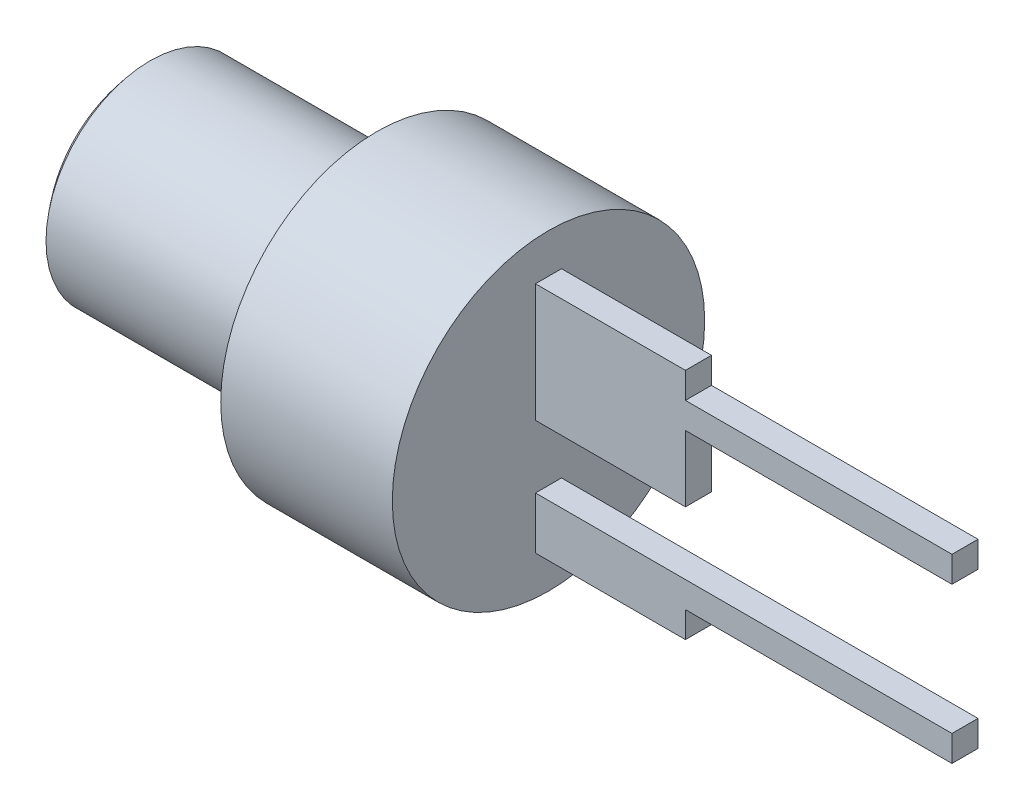
ISO-10303-21;
HEADER;
FILE_DESCRIPTION(('STEP AP214'),'2;1');
FILE_NAME('part.step','',(''),(''),'','','');
FILE_SCHEMA(('AUTOMOTIVE_DESIGN { 1 0 10303 214 1 1 1 1 }'));
ENDSEC;
DATA;
#1=APPLICATION_CONTEXT('core data for automotive mechanical design processes');
#2=APPLICATION_PROTOCOL_DEFINITION('international standard','automotive_design',2000,#1);
#3=PRODUCT_CONTEXT('',#1,'mechanical');
#4=PRODUCT('Part','Part','',(#3));
#5=PRODUCT_RELATED_PRODUCT_CATEGORY('part','',(#4));
#6=PRODUCT_DEFINITION_FORMATION('','',#4);
#7=PRODUCT_DEFINITION_CONTEXT('part definition',#1,'design');
#8=PRODUCT_DEFINITION('design','',#6,#7);
#9=PRODUCT_DEFINITION_SHAPE('','',#8);
#10=(LENGTH_UNIT() NAMED_UNIT(*) SI_UNIT(.MILLI.,.METRE.));
#11=(NAMED_UNIT(*) PLANE_ANGLE_UNIT() SI_UNIT($,.RADIAN.));
#12=(NAMED_UNIT(*) SI_UNIT($,.STERADIAN.) SOLID_ANGLE_UNIT());
#13=UNCERTAINTY_MEASURE_WITH_UNIT(LENGTH_MEASURE(1.E-05),#10,'distance_accuracy_value','');
#14=(GEOMETRIC_REPRESENTATION_CONTEXT(3) GLOBAL_UNCERTAINTY_ASSIGNED_CONTEXT((#13)) GLOBAL_UNIT_ASSIGNED_CONTEXT((#10,
#11,#12)) REPRESENTATION_CONTEXT('',''));
#15=CARTESIAN_POINT('',(0.,0.,0.));
#16=DIRECTION('',(0.,0.,1.));
#17=DIRECTION('',(1.,0.,0.));
#18=AXIS2_PLACEMENT_3D('',#15,#16,#17);
#19=CARTESIAN_POINT('',(0.,0.,0.));
#20=DIRECTION('',(1.,0.,0.));
#21=DIRECTION('',(0.,1.,0.));
#22=AXIS2_PLACEMENT_3D('',#19,#20,#21);
#23=PLANE('',#22);
#24=DIRECTION('',(0.,0.,-1.));
#25=VECTOR('',#24,1.);
#26=CARTESIAN_POINT('',(0.,-0.0508000000000003,0.396875));
#27=LINE('',#26,#25);
#28=CARTESIAN_POINT('',(0.,-0.0508000000000003,0.396875));
#29=VERTEX_POINT('',#28);
#30=CARTESIAN_POINT('',(0.,-0.0508000000000003,-0.396875));
#31=VERTEX_POINT('',#30);
#32=EDGE_CURVE('E563',#29,#31,#27,.T.);
#33=ORIENTED_EDGE('',*,*,#32,.F.);
#34=DIRECTION('',(0.,-1.,0.));
#35=VECTOR('',#34,1.);
#36=CARTESIAN_POINT('',(0.,3.556,0.396875));
#37=LINE('',#36,#35);
#38=CARTESIAN_POINT('',(0.,3.556,0.396875));
#39=VERTEX_POINT('',#38);
#40=EDGE_CURVE('E536',#39,#29,#37,.T.);
#41=ORIENTED_EDGE('',*,*,#40,.F.);
#42=DIRECTION('',(0.,0.,-1.));
#43=VECTOR('',#42,1.);
#44=CARTESIAN_POINT('',(0.,3.556,0.396875));
#45=LINE('',#44,#43);
#46=CARTESIAN_POINT('',(0.,3.556,-0.396875));
#47=VERTEX_POINT('',#46);
#48=EDGE_CURVE('E566',#39,#47,#45,.T.);
#49=ORIENTED_EDGE('',*,*,#48,.T.);
#50=DIRECTION('',(0.,-1.,0.));
#51=VECTOR('',#50,1.);
#52=CARTESIAN_POINT('',(0.,3.556,-0.396875));
#53=LINE('',#52,#51);
#54=EDGE_CURVE('E513',#47,#31,#53,.T.);
#55=ORIENTED_EDGE('',*,*,#54,.T.);
#56=EDGE_LOOP('',(#33,#41,#49,#55));
#57=FACE_BOUND('',#56,.T.);
#58=CARTESIAN_POINT('',(0.,0.,0.));
#59=DIRECTION('',(1.,0.,0.));
#60=DIRECTION('',(0.,1.,0.));
#61=AXIS2_PLACEMENT_3D('',#58,#59,#60);
#62=CIRCLE('',#61,4.7625);
#63=CARTESIAN_POINT('',(0.,4.7625,0.));
#64=VERTEX_POINT('',#63);
#65=EDGE_CURVE('E11',#64,#64,#62,.T.);
#66=ORIENTED_EDGE('',*,*,#65,.T.);
#67=EDGE_LOOP('',(#66));
#68=FACE_BOUND('',#67,.T.);
#69=DIRECTION('',(0.,0.,-1.));
#70=VECTOR('',#69,1.);
#71=CARTESIAN_POINT('',(0.,-3.556,0.396875));
#72=LINE('',#71,#70);
#73=CARTESIAN_POINT('',(0.,-3.556,0.396875));
#74=VERTEX_POINT('',#73);
#75=CARTESIAN_POINT('',(0.,-3.556,-0.396875));
#76=VERTEX_POINT('',#75);
#77=EDGE_CURVE('E374',#74,#76,#72,.T.);
#78=ORIENTED_EDGE('',*,*,#77,.F.);
#79=DIRECTION('',(0.,-1.,0.));
#80=VECTOR('',#79,1.);
#81=CARTESIAN_POINT('',(0.,-1.9685,0.396875));
#82=LINE('',#81,#80);
#83=CARTESIAN_POINT('',(0.,-1.9685,0.396875));
#84=VERTEX_POINT('',#83);
#85=EDGE_CURVE('E379',#84,#74,#82,.T.);
#86=ORIENTED_EDGE('',*,*,#85,.F.);
#87=DIRECTION('',(0.,0.,-1.));
#88=VECTOR('',#87,1.);
#89=CARTESIAN_POINT('',(0.,-1.9685,0.396875));
#90=LINE('',#89,#88);
#91=CARTESIAN_POINT('',(0.,-1.9685,-0.396875));
#92=VERTEX_POINT('',#91);
#93=EDGE_CURVE('E502',#84,#92,#90,.T.);
#94=ORIENTED_EDGE('',*,*,#93,.T.);
#95=DIRECTION('',(0.,-1.,0.));
#96=VECTOR('',#95,1.);
#97=CARTESIAN_POINT('',(0.,-1.9685,-0.396875));
#98=LINE('',#97,#96);
#99=EDGE_CURVE('E481',#92,#76,#98,.T.);
#100=ORIENTED_EDGE('',*,*,#99,.T.);
#101=EDGE_LOOP('',(#78,#86,#94,#100));
#102=FACE_BOUND('',#101,.T.);
#103=ADVANCED_FACE('F360',(#57,#68,#102),#23,.T.);
#104=CARTESIAN_POINT('',(0.,0.,0.));
#105=DIRECTION('',(1.,0.,0.));
#106=DIRECTION('',(0.,1.,0.));
#107=AXIS2_PLACEMENT_3D('',#104,#105,#106);
#108=CYLINDRICAL_SURFACE('',#107,4.7625);
#109=CARTESIAN_POINT('',(-5.2324,0.,0.));
#110=DIRECTION('',(1.,0.,0.));
#111=DIRECTION('',(0.,1.,0.));
#112=AXIS2_PLACEMENT_3D('',#109,#110,#111);
#113=CIRCLE('',#112,4.7625);
#114=CARTESIAN_POINT('',(-5.2324,4.7625,0.));
#115=VERTEX_POINT('',#114);
#116=EDGE_CURVE('E367',#115,#115,#113,.T.);
#117=ORIENTED_EDGE('',*,*,#116,.T.);
#118=EDGE_LOOP('',(#117));
#119=FACE_BOUND('',#118,.T.);
#120=ORIENTED_EDGE('',*,*,#65,.F.);
#121=EDGE_LOOP('',(#120));
#122=FACE_BOUND('',#121,.T.);
#123=ADVANCED_FACE('F576',(#119,#122),#108,.T.);
#124=CARTESIAN_POINT('',(-5.2324,3.175,0.));
#125=DIRECTION('',(-1.,0.,0.));
#126=DIRECTION('',(0.,-1.,0.));
#127=AXIS2_PLACEMENT_3D('',#124,#125,#126);
#128=PLANE('',#127);
#129=CARTESIAN_POINT('',(-5.2324,0.,0.));
#130=DIRECTION('',(1.,0.,0.));
#131=DIRECTION('',(0.,1.,0.));
#132=AXIS2_PLACEMENT_3D('',#129,#130,#131);
#133=CIRCLE('',#132,3.175);
#134=CARTESIAN_POINT('',(-5.2324,3.175,0.));
#135=VERTEX_POINT('',#134);
#136=EDGE_CURVE('E571',#135,#135,#133,.T.);
#137=ORIENTED_EDGE('',*,*,#136,.T.);
#138=EDGE_LOOP('',(#137));
#139=FACE_BOUND('',#138,.T.);
#140=ORIENTED_EDGE('',*,*,#116,.F.);
#141=EDGE_LOOP('',(#140));
#142=FACE_BOUND('',#141,.T.);
#143=ADVANCED_FACE('F579',(#139,#142),#128,.T.);
#144=CARTESIAN_POINT('',(0.,0.,0.));
#145=DIRECTION('',(1.,0.,0.));
#146=DIRECTION('',(0.,1.,0.));
#147=AXIS2_PLACEMENT_3D('',#144,#145,#146);
#148=CYLINDRICAL_SURFACE('',#147,3.175);
#149=CARTESIAN_POINT('',(-12.1476579142809,0.,0.));
#150=DIRECTION('',(1.,0.,0.));
#151=DIRECTION('',(0.,1.,0.));
#152=AXIS2_PLACEMENT_3D('',#149,#150,#151);
#153=CIRCLE('',#152,3.175);
#154=CARTESIAN_POINT('',(-12.1476579142809,3.175,0.));
#155=VERTEX_POINT('',#154);
#156=EDGE_CURVE('E568',#155,#155,#153,.T.);
#157=ORIENTED_EDGE('',*,*,#156,.T.);
#158=EDGE_LOOP('',(#157));
#159=FACE_BOUND('',#158,.T.);
#160=ORIENTED_EDGE('',*,*,#136,.F.);
#161=EDGE_LOOP('',(#160));
#162=FACE_BOUND('',#161,.T.);
#163=ADVANCED_FACE('F581',(#159,#162),#148,.T.);
#164=CARTESIAN_POINT('',(-8.5979,0.,0.));
#165=DIRECTION('',(1.,0.,0.));
#166=DIRECTION('',(0.,1.,0.));
#167=AXIS2_PLACEMENT_3D('',#164,#165,#166);
#168=SPHERICAL_SURFACE('',#167,4.7625);
#169=ORIENTED_EDGE('',*,*,#156,.F.);
#170=EDGE_LOOP('',(#169));
#171=FACE_BOUND('',#170,.T.);
#172=ADVANCED_FACE('F588',(#171),#168,.T.);
#173=CARTESIAN_POINT('',(0.,3.556,0.396875));
#174=DIRECTION('',(0.,-1.,0.));
#175=DIRECTION('',(0.,0.,-1.));
#176=AXIS2_PLACEMENT_3D('',#173,#174,#175);
#177=PLANE('',#176);
#178=DIRECTION('',(0.,0.,-1.));
#179=VECTOR('',#178,1.);
#180=CARTESIAN_POINT('',(4.572,3.556,0.396875));
#181=LINE('',#180,#179);
#182=CARTESIAN_POINT('',(4.572,3.556,0.396875));
#183=VERTEX_POINT('',#182);
#184=CARTESIAN_POINT('',(4.572,3.556,-0.396875));
#185=VERTEX_POINT('',#184);
#186=EDGE_CURVE('E551',#183,#185,#181,.T.);
#187=ORIENTED_EDGE('',*,*,#186,.T.);
#188=DIRECTION('',(-1.,0.,0.));
#189=VECTOR('',#188,1.);
#190=CARTESIAN_POINT('',(0.,3.556,-0.396875));
#191=LINE('',#190,#189);
#192=EDGE_CURVE('E510',#185,#47,#191,.T.);
#193=ORIENTED_EDGE('',*,*,#192,.T.);
#194=ORIENTED_EDGE('',*,*,#48,.F.);
#195=DIRECTION('',(-1.,0.,0.));
#196=VECTOR('',#195,1.);
#197=CARTESIAN_POINT('',(0.,3.556,0.396875));
#198=LINE('',#197,#196);
#199=EDGE_CURVE('E533',#183,#39,#198,.T.);
#200=ORIENTED_EDGE('',*,*,#199,.F.);
#201=EDGE_LOOP('',(#187,#193,#194,#200));
#202=FACE_BOUND('',#201,.T.);
#203=ADVANCED_FACE('F636',(#202),#177,.F.);
#204=CARTESIAN_POINT('',(4.572,-0.0507999999999997,0.396875));
#205=DIRECTION('',(0.,1.,0.));
#206=DIRECTION('',(-1.,0.,0.));
#207=AXIS2_PLACEMENT_3D('',#204,#205,#206);
#208=PLANE('',#207);
#209=ORIENTED_EDGE('',*,*,#32,.T.);
#210=DIRECTION('',(1.,0.,0.));
#211=VECTOR('',#210,1.);
#212=CARTESIAN_POINT('',(4.572,-0.0507999999999997,-0.396875));
#213=LINE('',#212,#211);
#214=CARTESIAN_POINT('',(4.572,-0.0507999999999997,-0.396875));
#215=VERTEX_POINT('',#214);
#216=EDGE_CURVE('E515',#31,#215,#213,.T.);
#217=ORIENTED_EDGE('',*,*,#216,.T.);
#218=DIRECTION('',(0.,0.,-1.));
#219=VECTOR('',#218,1.);
#220=CARTESIAN_POINT('',(4.572,-0.0507999999999997,0.396875));
#221=LINE('',#220,#219);
#222=CARTESIAN_POINT('',(4.572,-0.0507999999999997,0.396875));
#223=VERTEX_POINT('',#222);
#224=EDGE_CURVE('E561',#223,#215,#221,.T.);
#225=ORIENTED_EDGE('',*,*,#224,.F.);
#226=DIRECTION('',(1.,0.,0.));
#227=VECTOR('',#226,1.);
#228=CARTESIAN_POINT('',(4.572,-0.0507999999999997,0.396875));
#229=LINE('',#228,#227);
#230=EDGE_CURVE('E539',#29,#223,#229,.T.);
#231=ORIENTED_EDGE('',*,*,#230,.F.);
#232=EDGE_LOOP('',(#209,#217,#225,#231));
#233=FACE_BOUND('',#232,.T.);
#234=ADVANCED_FACE('F608',(#233),#208,.F.);
#235=CARTESIAN_POINT('',(4.572,1.9685,0.396875));
#236=DIRECTION('',(-1.,0.,0.));
#237=DIRECTION('',(0.,0.,1.));
#238=AXIS2_PLACEMENT_3D('',#235,#236,#237);
#239=PLANE('',#238);
#240=ORIENTED_EDGE('',*,*,#224,.T.);
#241=DIRECTION('',(0.,1.,0.));
#242=VECTOR('',#241,1.);
#243=CARTESIAN_POINT('',(4.572,1.9685,-0.396875));
#244=LINE('',#243,#242);
#245=CARTESIAN_POINT('',(4.572,1.9685,-0.396875));
#246=VERTEX_POINT('',#245);
#247=EDGE_CURVE('E518',#215,#246,#244,.T.);
#248=ORIENTED_EDGE('',*,*,#247,.T.);
#249=DIRECTION('',(0.,0.,-1.));
#250=VECTOR('',#249,1.);
#251=CARTESIAN_POINT('',(4.572,1.9685,0.396875));
#252=LINE('',#251,#250);
#253=CARTESIAN_POINT('',(4.572,1.9685,0.396875));
#254=VERTEX_POINT('',#253);
#255=EDGE_CURVE('E559',#254,#246,#252,.T.);
#256=ORIENTED_EDGE('',*,*,#255,.F.);
#257=DIRECTION('',(0.,1.,0.));
#258=VECTOR('',#257,1.);
#259=CARTESIAN_POINT('',(4.572,1.9685,0.396875));
#260=LINE('',#259,#258);
#261=EDGE_CURVE('E541',#223,#254,#260,.T.);
#262=ORIENTED_EDGE('',*,*,#261,.F.);
#263=EDGE_LOOP('',(#240,#248,#256,#262));
#264=FACE_BOUND('',#263,.T.);
#265=ADVANCED_FACE('F613',(#264),#239,.F.);
#266=CARTESIAN_POINT('',(12.7,1.9685,0.396875));
#267=DIRECTION('',(0.,1.,0.));
#268=DIRECTION('',(-1.,0.,0.));
#269=AXIS2_PLACEMENT_3D('',#266,#267,#268);
#270=PLANE('',#269);
#271=ORIENTED_EDGE('',*,*,#255,.T.);
#272=DIRECTION('',(1.,0.,0.));
#273=VECTOR('',#272,1.);
#274=CARTESIAN_POINT('',(12.7,1.9685,-0.396875));
#275=LINE('',#274,#273);
#276=CARTESIAN_POINT('',(12.7,1.9685,-0.396875));
#277=VERTEX_POINT('',#276);
#278=EDGE_CURVE('E521',#246,#277,#275,.T.);
#279=ORIENTED_EDGE('',*,*,#278,.T.);
#280=DIRECTION('',(0.,0.,-1.));
#281=VECTOR('',#280,1.);
#282=CARTESIAN_POINT('',(12.7,1.9685,0.396875));
#283=LINE('',#282,#281);
#284=CARTESIAN_POINT('',(12.7,1.9685,0.396875));
#285=VERTEX_POINT('',#284);
#286=EDGE_CURVE('E557',#285,#277,#283,.T.);
#287=ORIENTED_EDGE('',*,*,#286,.F.);
#288=DIRECTION('',(1.,0.,0.));
#289=VECTOR('',#288,1.);
#290=CARTESIAN_POINT('',(12.7,1.9685,0.396875));
#291=LINE('',#290,#289);
#292=EDGE_CURVE('E543',#254,#285,#291,.T.);
#293=ORIENTED_EDGE('',*,*,#292,.F.);
#294=EDGE_LOOP('',(#271,#279,#287,#293));
#295=FACE_BOUND('',#294,.T.);
#296=ADVANCED_FACE('F619',(#295),#270,.F.);
#297=CARTESIAN_POINT('',(12.7,2.76225,0.396875));
#298=DIRECTION('',(-1.,0.,0.));
#299=DIRECTION('',(0.,0.,1.));
#300=AXIS2_PLACEMENT_3D('',#297,#298,#299);
#301=PLANE('',#300);
#302=ORIENTED_EDGE('',*,*,#286,.T.);
#303=DIRECTION('',(0.,1.,0.));
#304=VECTOR('',#303,1.);
#305=CARTESIAN_POINT('',(12.7,2.76225,-0.396875));
#306=LINE('',#305,#304);
#307=CARTESIAN_POINT('',(12.7,2.76225,-0.396875));
#308=VERTEX_POINT('',#307);
#309=EDGE_CURVE('E524',#277,#308,#306,.T.);
#310=ORIENTED_EDGE('',*,*,#309,.T.);
#311=DIRECTION('',(0.,0.,-1.));
#312=VECTOR('',#311,1.);
#313=CARTESIAN_POINT('',(12.7,2.76225,0.396875));
#314=LINE('',#313,#312);
#315=CARTESIAN_POINT('',(12.7,2.76225,0.396875));
#316=VERTEX_POINT('',#315);
#317=EDGE_CURVE('E555',#316,#308,#314,.T.);
#318=ORIENTED_EDGE('',*,*,#317,.F.);
#319=DIRECTION('',(0.,1.,0.));
#320=VECTOR('',#319,1.);
#321=CARTESIAN_POINT('',(12.7,2.76225,0.396875));
#322=LINE('',#321,#320);
#323=EDGE_CURVE('E545',#285,#316,#322,.T.);
#324=ORIENTED_EDGE('',*,*,#323,.F.);
#325=EDGE_LOOP('',(#302,#310,#318,#324));
#326=FACE_BOUND('',#325,.T.);
#327=ADVANCED_FACE('F623',(#326),#301,.F.);
#328=CARTESIAN_POINT('',(4.572,2.76225,0.396875));
#329=DIRECTION('',(0.,-1.,0.));
#330=DIRECTION('',(0.,0.,-1.));
#331=AXIS2_PLACEMENT_3D('',#328,#329,#330);
#332=PLANE('',#331);
#333=ORIENTED_EDGE('',*,*,#317,.T.);
#334=DIRECTION('',(-1.,0.,0.));
#335=VECTOR('',#334,1.);
#336=CARTESIAN_POINT('',(4.572,2.76225,-0.396875));
#337=LINE('',#336,#335);
#338=CARTESIAN_POINT('',(4.572,2.76225,-0.396875));
#339=VERTEX_POINT('',#338);
#340=EDGE_CURVE('E527',#308,#339,#337,.T.);
#341=ORIENTED_EDGE('',*,*,#340,.T.);
#342=DIRECTION('',(0.,0.,-1.));
#343=VECTOR('',#342,1.);
#344=CARTESIAN_POINT('',(4.572,2.76225,0.396875));
#345=LINE('',#344,#343);
#346=CARTESIAN_POINT('',(4.572,2.76225,0.396875));
#347=VERTEX_POINT('',#346);
#348=EDGE_CURVE('E553',#347,#339,#345,.T.);
#349=ORIENTED_EDGE('',*,*,#348,.F.);
#350=DIRECTION('',(-1.,0.,0.));
#351=VECTOR('',#350,1.);
#352=CARTESIAN_POINT('',(4.572,2.76225,0.396875));
#353=LINE('',#352,#351);
#354=EDGE_CURVE('E547',#316,#347,#353,.T.);
#355=ORIENTED_EDGE('',*,*,#354,.F.);
#356=EDGE_LOOP('',(#333,#341,#349,#355));
#357=FACE_BOUND('',#356,.T.);
#358=ADVANCED_FACE('F628',(#357),#332,.F.);
#359=CARTESIAN_POINT('',(4.572,3.556,0.396875));
#360=DIRECTION('',(-1.,0.,0.));
#361=DIRECTION('',(0.,0.,1.));
#362=AXIS2_PLACEMENT_3D('',#359,#360,#361);
#363=PLANE('',#362);
#364=ORIENTED_EDGE('',*,*,#348,.T.);
#365=DIRECTION('',(0.,1.,0.));
#366=VECTOR('',#365,1.);
#367=CARTESIAN_POINT('',(4.572,3.556,-0.396875));
#368=LINE('',#367,#366);
#369=EDGE_CURVE('E530',#339,#185,#368,.T.);
#370=ORIENTED_EDGE('',*,*,#369,.T.);
#371=ORIENTED_EDGE('',*,*,#186,.F.);
#372=DIRECTION('',(0.,1.,0.));
#373=VECTOR('',#372,1.);
#374=CARTESIAN_POINT('',(4.572,3.556,0.396875));
#375=LINE('',#374,#373);
#376=EDGE_CURVE('E549',#347,#183,#375,.T.);
#377=ORIENTED_EDGE('',*,*,#376,.F.);
#378=EDGE_LOOP('',(#364,#370,#371,#377));
#379=FACE_BOUND('',#378,.T.);
#380=ADVANCED_FACE('F632',(#379),#363,.F.);
#381=CARTESIAN_POINT('',(4.572,3.556,0.396875));
#382=DIRECTION('',(0.,0.,-1.));
#383=DIRECTION('',(-1.,0.,0.));
#384=AXIS2_PLACEMENT_3D('',#381,#382,#383);
#385=PLANE('',#384);
#386=ORIENTED_EDGE('',*,*,#199,.T.);
#387=ORIENTED_EDGE('',*,*,#40,.T.);
#388=ORIENTED_EDGE('',*,*,#230,.T.);
#389=ORIENTED_EDGE('',*,*,#261,.T.);
#390=ORIENTED_EDGE('',*,*,#292,.T.);
#391=ORIENTED_EDGE('',*,*,#323,.T.);
#392=ORIENTED_EDGE('',*,*,#354,.T.);
#393=ORIENTED_EDGE('',*,*,#376,.T.);
#394=EDGE_LOOP('',(#386,#387,#388,#389,#390,#391,#392,#393));
#395=FACE_BOUND('',#394,.T.);
#396=ADVANCED_FACE('F604',(#395),#385,.F.);
#397=CARTESIAN_POINT('',(4.572,3.556,-0.396875));
#398=DIRECTION('',(0.,0.,-1.));
#399=DIRECTION('',(-1.,0.,0.));
#400=AXIS2_PLACEMENT_3D('',#397,#398,#399);
#401=PLANE('',#400);
#402=ORIENTED_EDGE('',*,*,#192,.F.);
#403=ORIENTED_EDGE('',*,*,#369,.F.);
#404=ORIENTED_EDGE('',*,*,#340,.F.);
#405=ORIENTED_EDGE('',*,*,#309,.F.);
#406=ORIENTED_EDGE('',*,*,#278,.F.);
#407=ORIENTED_EDGE('',*,*,#247,.F.);
#408=ORIENTED_EDGE('',*,*,#216,.F.);
#409=ORIENTED_EDGE('',*,*,#54,.F.);
#410=EDGE_LOOP('',(#402,#403,#404,#405,#406,#407,#408,#409));
#411=FACE_BOUND('',#410,.T.);
#412=ADVANCED_FACE('F638',(#411),#401,.T.);
#413=CARTESIAN_POINT('',(4.572,-3.556,0.396875));
#414=DIRECTION('',(0.,1.,0.));
#415=DIRECTION('',(-1.,0.,0.));
#416=AXIS2_PLACEMENT_3D('',#413,#414,#415);
#417=PLANE('',#416);
#418=ORIENTED_EDGE('',*,*,#77,.T.);
#419=DIRECTION('',(1.,0.,0.));
#420=VECTOR('',#419,1.);
#421=CARTESIAN_POINT('',(4.572,-3.556,-0.396875));
#422=LINE('',#421,#420);
#423=CARTESIAN_POINT('',(4.572,-3.556,-0.396875));
#424=VERTEX_POINT('',#423);
#425=EDGE_CURVE('E475',#76,#424,#422,.T.);
#426=ORIENTED_EDGE('',*,*,#425,.T.);
#427=DIRECTION('',(0.,0.,-1.));
#428=VECTOR('',#427,1.);
#429=CARTESIAN_POINT('',(4.572,-3.556,0.396875));
#430=LINE('',#429,#428);
#431=CARTESIAN_POINT('',(4.572,-3.556,0.396875));
#432=VERTEX_POINT('',#431);
#433=EDGE_CURVE('E460',#432,#424,#430,.T.);
#434=ORIENTED_EDGE('',*,*,#433,.F.);
#435=DIRECTION('',(1.,0.,0.));
#436=VECTOR('',#435,1.);
#437=CARTESIAN_POINT('',(4.572,-3.556,0.396875));
#438=LINE('',#437,#436);
#439=EDGE_CURVE('E493',#74,#432,#438,.T.);
#440=ORIENTED_EDGE('',*,*,#439,.F.);
#441=EDGE_LOOP('',(#418,#426,#434,#440));
#442=FACE_BOUND('',#441,.T.);
#443=ADVANCED_FACE('F480',(#442),#417,.F.);
#444=CARTESIAN_POINT('',(4.572,-2.76225,0.396875));
#445=DIRECTION('',(-1.,0.,0.));
#446=DIRECTION('',(0.,-1.,0.));
#447=AXIS2_PLACEMENT_3D('',#444,#445,#446);
#448=PLANE('',#447);
#449=ORIENTED_EDGE('',*,*,#433,.T.);
#450=DIRECTION('',(0.,1.,0.));
#451=VECTOR('',#450,1.);
#452=CARTESIAN_POINT('',(4.572,-2.76225,-0.396875));
#453=LINE('',#452,#451);
#454=CARTESIAN_POINT('',(4.572,-2.76225,-0.396875));
#455=VERTEX_POINT('',#454);
#456=EDGE_CURVE('E464',#424,#455,#453,.T.);
#457=ORIENTED_EDGE('',*,*,#456,.T.);
#458=DIRECTION('',(0.,0.,-1.));
#459=VECTOR('',#458,1.);
#460=CARTESIAN_POINT('',(4.572,-2.76225,0.396875));
#461=LINE('',#460,#459);
#462=CARTESIAN_POINT('',(4.572,-2.76225,0.396875));
#463=VERTEX_POINT('',#462);
#464=EDGE_CURVE('E468',#463,#455,#461,.T.);
#465=ORIENTED_EDGE('',*,*,#464,.F.);
#466=DIRECTION('',(0.,1.,0.));
#467=VECTOR('',#466,1.);
#468=CARTESIAN_POINT('',(4.572,-2.76225,0.396875));
#469=LINE('',#468,#467);
#470=EDGE_CURVE('E465',#432,#463,#469,.T.);
#471=ORIENTED_EDGE('',*,*,#470,.F.);
#472=EDGE_LOOP('',(#449,#457,#465,#471));
#473=FACE_BOUND('',#472,.T.);
#474=ADVANCED_FACE('F462',(#473),#448,.F.);
#475=CARTESIAN_POINT('',(12.7,-2.76225,0.396875));
#476=DIRECTION('',(0.,1.,0.));
#477=DIRECTION('',(-1.,0.,0.));
#478=AXIS2_PLACEMENT_3D('',#475,#476,#477);
#479=PLANE('',#478);
#480=ORIENTED_EDGE('',*,*,#464,.T.);
#481=DIRECTION('',(1.,0.,0.));
#482=VECTOR('',#481,1.);
#483=CARTESIAN_POINT('',(12.7,-2.76225,-0.396875));
#484=LINE('',#483,#482);
#485=CARTESIAN_POINT('',(12.7,-2.76225,-0.396875));
#486=VERTEX_POINT('',#485);
#487=EDGE_CURVE('E478',#455,#486,#484,.T.);
#488=ORIENTED_EDGE('',*,*,#487,.T.);
#489=DIRECTION('',(0.,0.,-1.));
#490=VECTOR('',#489,1.);
#491=CARTESIAN_POINT('',(12.7,-2.76225,0.396875));
#492=LINE('',#491,#490);
#493=CARTESIAN_POINT('',(12.7,-2.76225,0.396875));
#494=VERTEX_POINT('',#493);
#495=EDGE_CURVE('E506',#494,#486,#492,.T.);
#496=ORIENTED_EDGE('',*,*,#495,.F.);
#497=DIRECTION('',(1.,0.,0.));
#498=VECTOR('',#497,1.);
#499=CARTESIAN_POINT('',(12.7,-2.76225,0.396875));
#500=LINE('',#499,#498);
#501=EDGE_CURVE('E496',#463,#494,#500,.T.);
#502=ORIENTED_EDGE('',*,*,#501,.F.);
#503=EDGE_LOOP('',(#480,#488,#496,#502));
#504=FACE_BOUND('',#503,.T.);
#505=ADVANCED_FACE('F725',(#504),#479,.F.);
#506=CARTESIAN_POINT('',(12.7,-1.9685,0.396875));
#507=DIRECTION('',(-1.,0.,0.));
#508=DIRECTION('',(0.,0.,1.));
#509=AXIS2_PLACEMENT_3D('',#506,#507,#508);
#510=PLANE('',#509);
#511=ORIENTED_EDGE('',*,*,#495,.T.);
#512=DIRECTION('',(0.,1.,0.));
#513=VECTOR('',#512,1.);
#514=CARTESIAN_POINT('',(12.7,-1.9685,-0.396875));
#515=LINE('',#514,#513);
#516=CARTESIAN_POINT('',(12.7,-1.9685,-0.396875));
#517=VERTEX_POINT('',#516);
#518=EDGE_CURVE('E486',#486,#517,#515,.T.);
#519=ORIENTED_EDGE('',*,*,#518,.T.);
#520=DIRECTION('',(0.,0.,-1.));
#521=VECTOR('',#520,1.);
#522=CARTESIAN_POINT('',(12.7,-1.9685,0.396875));
#523=LINE('',#522,#521);
#524=CARTESIAN_POINT('',(12.7,-1.9685,0.396875));
#525=VERTEX_POINT('',#524);
#526=EDGE_CURVE('E504',#525,#517,#523,.T.);
#527=ORIENTED_EDGE('',*,*,#526,.F.);
#528=DIRECTION('',(0.,1.,0.));
#529=VECTOR('',#528,1.);
#530=CARTESIAN_POINT('',(12.7,-1.9685,0.396875));
#531=LINE('',#530,#529);
#532=EDGE_CURVE('E498',#494,#525,#531,.T.);
#533=ORIENTED_EDGE('',*,*,#532,.F.);
#534=EDGE_LOOP('',(#511,#519,#527,#533));
#535=FACE_BOUND('',#534,.T.);
#536=ADVANCED_FACE('F731',(#535),#510,.F.);
#537=CARTESIAN_POINT('',(0.,-1.9685,0.396875));
#538=DIRECTION('',(0.,-1.,0.));
#539=DIRECTION('',(0.,0.,-1.));
#540=AXIS2_PLACEMENT_3D('',#537,#538,#539);
#541=PLANE('',#540);
#542=ORIENTED_EDGE('',*,*,#526,.T.);
#543=DIRECTION('',(-1.,0.,0.));
#544=VECTOR('',#543,1.);
#545=CARTESIAN_POINT('',(0.,-1.9685,-0.396875));
#546=LINE('',#545,#544);
#547=EDGE_CURVE('E489',#517,#92,#546,.T.);
#548=ORIENTED_EDGE('',*,*,#547,.T.);
#549=ORIENTED_EDGE('',*,*,#93,.F.);
#550=DIRECTION('',(-1.,0.,0.));
#551=VECTOR('',#550,1.);
#552=CARTESIAN_POINT('',(0.,-1.9685,0.396875));
#553=LINE('',#552,#551);
#554=EDGE_CURVE('E500',#525,#84,#553,.T.);
#555=ORIENTED_EDGE('',*,*,#554,.F.);
#556=EDGE_LOOP('',(#542,#548,#549,#555));
#557=FACE_BOUND('',#556,.T.);
#558=ADVANCED_FACE('F739',(#557),#541,.F.);
#559=CARTESIAN_POINT('',(0.,-3.556,0.396875));
#560=DIRECTION('',(0.,0.,-1.));
#561=DIRECTION('',(-1.,0.,0.));
#562=AXIS2_PLACEMENT_3D('',#559,#560,#561);
#563=PLANE('',#562);
#564=ORIENTED_EDGE('',*,*,#85,.T.);
#565=ORIENTED_EDGE('',*,*,#439,.T.);
#566=ORIENTED_EDGE('',*,*,#470,.T.);
#567=ORIENTED_EDGE('',*,*,#501,.T.);
#568=ORIENTED_EDGE('',*,*,#532,.T.);
#569=ORIENTED_EDGE('',*,*,#554,.T.);
#570=EDGE_LOOP('',(#564,#565,#566,#567,#568,#569));
#571=FACE_BOUND('',#570,.T.);
#572=ADVANCED_FACE('F747',(#571),#563,.F.);
#573=CARTESIAN_POINT('',(0.,-3.556,-0.396875));
#574=DIRECTION('',(0.,0.,-1.));
#575=DIRECTION('',(-1.,0.,0.));
#576=AXIS2_PLACEMENT_3D('',#573,#574,#575);
#577=PLANE('',#576);
#578=ORIENTED_EDGE('',*,*,#99,.F.);
#579=ORIENTED_EDGE('',*,*,#547,.F.);
#580=ORIENTED_EDGE('',*,*,#518,.F.);
#581=ORIENTED_EDGE('',*,*,#487,.F.);
#582=ORIENTED_EDGE('',*,*,#456,.F.);
#583=ORIENTED_EDGE('',*,*,#425,.F.);
#584=EDGE_LOOP('',(#578,#579,#580,#581,#582,#583));
#585=FACE_BOUND('',#584,.T.);
#586=ADVANCED_FACE('F474',(#585),#577,.T.);
#587=CLOSED_SHELL('',(#103,#123,#143,#163,#172,#203,#234,#265,#296,#327,#358,#380,#396,#412,
#443,#474,#505,#536,#558,#572,#586));
#588=MANIFOLD_SOLID_BREP('B2',#587);
#589=ADVANCED_BREP_SHAPE_REPRESENTATION('',(#18,#588),#14);
#590=SHAPE_DEFINITION_REPRESENTATION(#9,#589);
ENDSEC;
END-ISO-10303-21;
